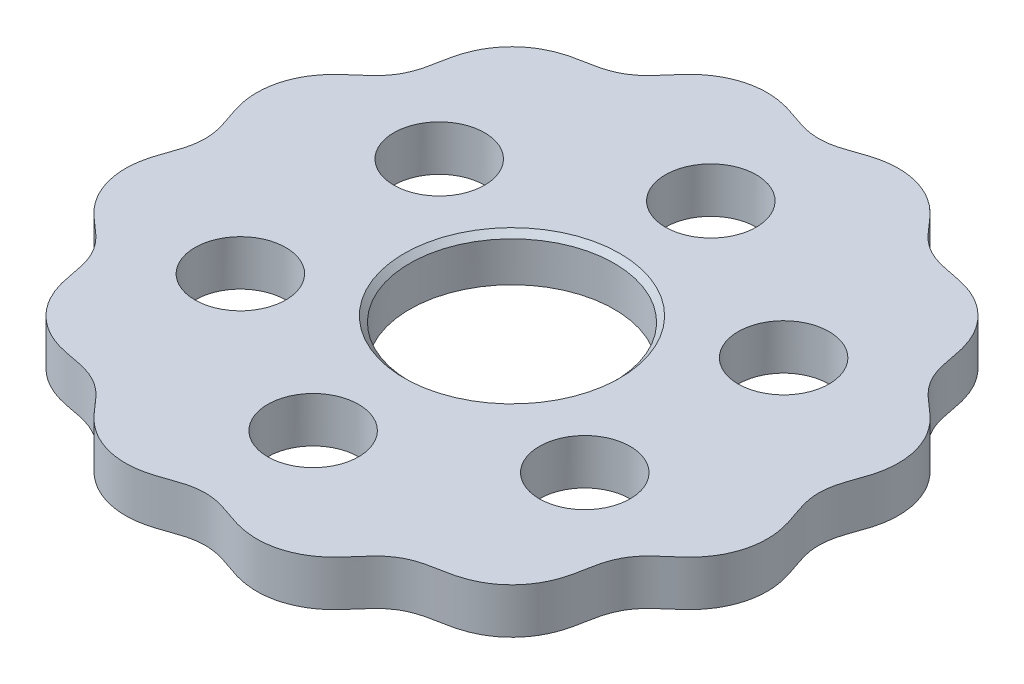
ISO-10303-21;
HEADER;
FILE_DESCRIPTION(('STEP AP214'),'2;1');
FILE_NAME('part.step','',(''),(''),'','','');
FILE_SCHEMA(('AUTOMOTIVE_DESIGN { 1 0 10303 214 1 1 1 1 }'));
ENDSEC;
DATA;
#1=APPLICATION_CONTEXT('core data for automotive mechanical design processes');
#2=APPLICATION_PROTOCOL_DEFINITION('international standard','automotive_design',2000,#1);
#3=PRODUCT_CONTEXT('',#1,'mechanical');
#4=PRODUCT('Part','Part','',(#3));
#5=PRODUCT_RELATED_PRODUCT_CATEGORY('part','',(#4));
#6=PRODUCT_DEFINITION_FORMATION('','',#4);
#7=PRODUCT_DEFINITION_CONTEXT('part definition',#1,'design');
#8=PRODUCT_DEFINITION('design','',#6,#7);
#9=PRODUCT_DEFINITION_SHAPE('','',#8);
#10=(LENGTH_UNIT() NAMED_UNIT(*) SI_UNIT(.MILLI.,.METRE.));
#11=(NAMED_UNIT(*) PLANE_ANGLE_UNIT() SI_UNIT($,.RADIAN.));
#12=(NAMED_UNIT(*) SI_UNIT($,.STERADIAN.) SOLID_ANGLE_UNIT());
#13=UNCERTAINTY_MEASURE_WITH_UNIT(LENGTH_MEASURE(1.E-05),#10,'distance_accuracy_value','');
#14=(GEOMETRIC_REPRESENTATION_CONTEXT(3) GLOBAL_UNCERTAINTY_ASSIGNED_CONTEXT((#13)) GLOBAL_UNIT_ASSIGNED_CONTEXT((#10,
#11,#12)) REPRESENTATION_CONTEXT('',''));
#15=CARTESIAN_POINT('',(0.,0.,0.));
#16=DIRECTION('',(0.,0.,1.));
#17=DIRECTION('',(1.,0.,0.));
#18=AXIS2_PLACEMENT_3D('',#15,#16,#17);
#19=CARTESIAN_POINT('',(27.,4.,9.22800886957361E-11));
#20=DIRECTION('',(-0.999999926527916,0.,-0.000383332964961151));
#21=DIRECTION('',(-0.000383332964961151,0.,0.999999926527916));
#22=AXIS2_PLACEMENT_3D('',#19,#20,#21);
#23=PLANE('',#22);
#24=CARTESIAN_POINT('',(27.,0.,9.22800886957361E-11));
#25=CARTESIAN_POINT('',(27.0000015716642,0.,-0.00409999716100518));
#26=B_SPLINE_CURVE_WITH_KNOTS('',1,(#24,#25),.UNSPECIFIED.,.F.,.F.,(2,2),(0.,1.),.UNSPECIFIED.);
#27=CARTESIAN_POINT('',(27.,0.,1.15350105787478E-10));
#28=VERTEX_POINT('',#27);
#29=CARTESIAN_POINT('',(27.0000015716642,0.,-0.0040999970740738));
#30=VERTEX_POINT('',#29);
#31=EDGE_CURVE('E83',#28,#30,#26,.T.);
#32=ORIENTED_EDGE('',*,*,#31,.T.);
#33=DIRECTION('',(0.,-1.,0.));
#34=VECTOR('',#33,1.);
#35=CARTESIAN_POINT('',(27.0000015716642,4.,-0.0040999970740738));
#36=LINE('',#35,#34);
#37=CARTESIAN_POINT('',(27.0000015716642,4.,-0.0040999970740738));
#38=VERTEX_POINT('',#37);
#39=EDGE_CURVE('E79',#38,#30,#36,.T.);
#40=ORIENTED_EDGE('',*,*,#39,.F.);
#41=CARTESIAN_POINT('',(27.,4.,9.22800886957361E-11));
#42=CARTESIAN_POINT('',(27.0000015716642,4.,-0.00409999716100518));
#43=B_SPLINE_CURVE_WITH_KNOTS('',1,(#41,#42),.UNSPECIFIED.,.F.,.F.,(2,2),(0.,1.),.UNSPECIFIED.);
#44=CARTESIAN_POINT('',(27.,4.,1.15350105787478E-10));
#45=VERTEX_POINT('',#44);
#46=EDGE_CURVE('E82',#45,#38,#43,.T.);
#47=ORIENTED_EDGE('',*,*,#46,.F.);
#48=DIRECTION('',(0.,-1.,0.));
#49=VECTOR('',#48,1.);
#50=CARTESIAN_POINT('',(27.,4.,1.15350105787478E-10));
#51=LINE('',#50,#49);
#52=EDGE_CURVE('E76',#45,#28,#51,.T.);
#53=ORIENTED_EDGE('',*,*,#52,.T.);
#54=EDGE_LOOP('',(#32,#40,#47,#53));
#55=FACE_BOUND('',#54,.T.);
#56=ADVANCED_FACE('F45',(#55),#23,.F.);
#57=CARTESIAN_POINT('',(27.0000015716642,4.,-0.0040999970740738));
#58=CARTESIAN_POINT('',(27.0000244484234,4.,-0.0339392810021794));
#59=CARTESIAN_POINT('',(27.0005304269458,4.,-0.07873320100623));
#60=CARTESIAN_POINT('',(27.002159238969,4.,-0.152753864287575));
#61=CARTESIAN_POINT('',(27.0079260189087,4.,-0.306185400184545));
#62=CARTESIAN_POINT('',(27.0198032377593,4.,-0.486134543892335));
#63=CARTESIAN_POINT('',(27.0442361711245,4.,-0.710209831575729));
#64=CARTESIAN_POINT('',(27.0884334298475,4.,-0.994680929823416));
#65=CARTESIAN_POINT('',(27.1457643024793,4.,-1.27114439302302));
#66=CARTESIAN_POINT('',(27.2321717977341,4.,-1.61674575590789));
#67=CARTESIAN_POINT('',(27.3560734123242,4.,-2.02396200951451));
#68=CARTESIAN_POINT('',(27.5210009056152,4.,-2.49350803824811));
#69=CARTESIAN_POINT('',(27.7162724516742,4.,-3.02678805022896));
#70=CARTESIAN_POINT('',(27.8972374228975,4.,-3.56570108518777));
#71=CARTESIAN_POINT('',(28.0642219258353,4.,-4.17060877528699));
#72=CARTESIAN_POINT('',(28.1930011060433,4.,-4.84554244802918));
#73=CARTESIAN_POINT('',(28.274636512001,4.,-5.79026897996571));
#74=CARTESIAN_POINT('',(28.1878772085396,4.,-6.99381965304455));
#75=CARTESIAN_POINT('',(27.8097902938465,4.,-8.35041784673789));
#76=CARTESIAN_POINT('',(27.0828678084063,4.,-9.64980286808452));
#77=CARTESIAN_POINT('',(26.1839296137999,4.,-10.6738779590738));
#78=CARTESIAN_POINT('',(25.2358125265582,4.,-11.4737802283782));
#79=CARTESIAN_POINT('',(24.370354005674,4.,-12.193123574296));
#80=CARTESIAN_POINT('',(23.6190605575602,4.,-13.0405595192683));
#81=CARTESIAN_POINT('',(23.0618295749504,4.,-14.027974654569));
#82=CARTESIAN_POINT('',(22.7225096076187,4.,-15.1079409428691));
#83=CARTESIAN_POINT('',(22.5401153959099,4.,-16.2179415220067));
#84=CARTESIAN_POINT('',(22.3106276044754,4.,-17.4374921197559));
#85=CARTESIAN_POINT('',(21.8545936867957,4.,-18.7217244182586));
#86=CARTESIAN_POINT('',(21.0767954527754,4.,-19.9840798535619));
#87=CARTESIAN_POINT('',(19.9418864008962,4.,-21.1099979467255));
#88=CARTESIAN_POINT('',(18.6734042785689,4.,-21.8777643942059));
#89=CARTESIAN_POINT('',(17.3858227799011,4.,-22.3240252437293));
#90=CARTESIAN_POINT('',(16.1654469621031,4.,-22.5476881375256));
#91=CARTESIAN_POINT('',(15.0558514955551,4.,-22.733997897836));
#92=CARTESIAN_POINT('',(13.9787577448736,4.,-23.0832138422773));
#93=CARTESIAN_POINT('',(12.9971431397588,4.,-23.6505932158244));
#94=CARTESIAN_POINT('',(12.1568472429252,4.,-24.409493008101));
#95=CARTESIAN_POINT('',(11.4410205779606,4.,-25.2775084306964));
#96=CARTESIAN_POINT('',(10.6367030906937,4.,-26.2222170973788));
#97=CARTESIAN_POINT('',(9.60578927405974,4.,-27.1134259413189));
#98=CARTESIAN_POINT('',(8.30610353361356,4.,-27.8270981610101));
#99=CARTESIAN_POINT('',(6.76325670490686,4.,-28.245828875078));
#100=CARTESIAN_POINT('',(5.28109437562332,4.,-28.2871231594632));
#101=CARTESIAN_POINT('',(3.94108532648328,4.,-28.0389745584077));
#102=CARTESIAN_POINT('',(2.77039275955104,4.,-27.627408479797));
#103=CARTESIAN_POINT('',(1.71776190423759,4.,-27.23068931312));
#104=CARTESIAN_POINT('',(0.612584807266868,4.,-26.985514684254));
#105=CARTESIAN_POINT('',(-0.521165890577715,4.,-26.9754952209441));
#106=CARTESIAN_POINT('',(-1.63049251996372,4.,-27.2033966215677));
#107=CARTESIAN_POINT('',(-2.68601217324515,4.,-27.5936229422302));
#108=CARTESIAN_POINT('',(-3.8530105532449,4.,-28.0143016070755));
#109=CARTESIAN_POINT('',(-5.18954444308002,4.,-28.2797825456004));
#110=CARTESIAN_POINT('',(-6.67836591286768,4.,-28.2585373638715));
#111=CARTESIAN_POINT('',(-8.23855985142709,4.,-27.8558107859252));
#112=CARTESIAN_POINT('',(-9.5592001005529,4.,-27.1475718954185));
#113=CARTESIAN_POINT('',(-10.6098942657333,4.,-26.250958295212));
#114=CARTESIAN_POINT('',(-11.4261266630729,4.,-25.2966701495425));
#115=CARTESIAN_POINT('',(-12.1475565882439,4.,-24.4184431986962));
#116=CARTESIAN_POINT('',(-12.9955308705807,4.,-23.6504733011948));
#117=CARTESIAN_POINT('',(-13.987888625458,4.,-23.0780544092839));
#118=CARTESIAN_POINT('',(-15.0771826127988,4.,-22.7284374440517));
#119=CARTESIAN_POINT('',(-16.198497390375,4.,-22.5430765422845));
#120=CARTESIAN_POINT('',(-17.4329889431198,4.,-22.3128862016379));
#121=CARTESIAN_POINT('',(-18.7345641510939,4.,-21.8505073756346));
#122=CARTESIAN_POINT('',(-20.0077601235838,4.,-21.0601479620353));
#123=CARTESIAN_POINT('',(-21.1359296453693,4.,-19.9096590050618));
#124=CARTESIAN_POINT('',(-21.8979671721226,4.,-18.6304633703646));
#125=CARTESIAN_POINT('',(-22.3355750875532,4.,-17.3400054274809));
#126=CARTESIAN_POINT('',(-22.554344619362,4.,-16.1189609672778));
#127=CARTESIAN_POINT('',(-22.7445040156435,4.,-15.0097784397211));
#128=CARTESIAN_POINT('',(-23.1025637929627,4.,-13.935358019104));
#129=CARTESIAN_POINT('',(-23.6788847882606,4.,-12.9589635684495));
#130=CARTESIAN_POINT('',(-24.4443617256028,4.,-12.1249831589227));
#131=CARTESIAN_POINT('',(-25.3144126941894,4.,-11.4119685054146));
#132=CARTESIAN_POINT('',(-26.2559014222923,4.,-10.6035408797703));
#133=CARTESIAN_POINT('',(-27.1402118481749,4.,-9.56661708953337));
#134=CARTESIAN_POINT('',(-27.8447418263077,4.,-8.26195281544402));
#135=CARTESIAN_POINT('',(-28.2525956334913,4.,-6.71619555673127));
#136=CARTESIAN_POINT('',(-28.2834838471351,4.,-5.23377926545721));
#137=CARTESIAN_POINT('',(-28.0263593102599,4.,-3.89553187590193));
#138=CARTESIAN_POINT('',(-27.6099703395077,4.,-2.72678284921799));
#139=CARTESIAN_POINT('',(-27.2164490273536,4.,-1.67272243958398));
#140=CARTESIAN_POINT('',(-26.9801395952342,4.,-0.565370051796549));
#141=CARTESIAN_POINT('',(-26.9804741873882,4.,0.5684228967716));
#142=CARTESIAN_POINT('',(-27.2173605456043,4.,1.67563666063786));
#143=CARTESIAN_POINT('',(-27.6110986637257,4.,2.72960050748098));
#144=CARTESIAN_POINT('',(-28.0271832981977,4.,3.89847299684735));
#145=CARTESIAN_POINT('',(-28.2837289031908,4.,5.23683637524653));
#146=CARTESIAN_POINT('',(-28.2521684066599,4.,6.71923822744481));
#147=CARTESIAN_POINT('',(-27.8436109551201,4.,8.26481003135531));
#148=CARTESIAN_POINT('',(-27.1384889851912,4.,9.56915416604704));
#149=CARTESIAN_POINT('',(-26.2537306947376,4.,10.6056908261978));
#150=CARTESIAN_POINT('',(-25.3120286722542,4.,11.4138474593151));
#151=CARTESIAN_POINT('',(-24.4421025478062,4.,12.1270350268679));
#152=CARTESIAN_POINT('',(-23.6770462052661,4.,12.9614232130097));
#153=CARTESIAN_POINT('',(-23.1013015770716,4.,13.9381572582798));
#154=CARTESIAN_POINT('',(-22.7438154949222,4.,15.0127542561048));
#155=CARTESIAN_POINT('',(-22.553915448645,4.,16.1219649218201));
#156=CARTESIAN_POINT('',(-22.3348376661072,4.,17.3429682603798));
#157=CARTESIAN_POINT('',(-21.8966704072072,4.,18.6332423824535));
#158=CARTESIAN_POINT('',(-21.1340538070914,4.,19.9120923021861));
#159=CARTESIAN_POINT('',(-20.0053600695423,4.,21.0620678102741));
#160=CARTESIAN_POINT('',(-18.7318062880613,4.,21.8518491030051));
#161=CARTESIAN_POINT('',(-17.4300345016617,4.,22.3136595922247));
#162=CARTESIAN_POINT('',(-16.1954960902811,4.,22.5435074477447));
#163=CARTESIAN_POINT('',(-15.0742060049806,4.,22.7290947932359));
#164=CARTESIAN_POINT('',(-13.9850809861389,4.,23.0792857186833));
#165=CARTESIAN_POINT('',(-12.9930603566187,4.,23.6522886562751));
#166=CARTESIAN_POINT('',(-12.1454986628799,4.,24.4206920699987));
#167=CARTESIAN_POINT('',(-11.4242529037972,4.,25.2990539408724));
#168=CARTESIAN_POINT('',(-10.6077475831555,4.,26.2531305077497));
#169=CARTESIAN_POINT('',(-9.5566594484237,4.,27.1492897931313));
#170=CARTESIAN_POINT('',(-8.23569735979198,4.,27.8569298047064));
#171=CARTESIAN_POINT('',(-6.67532074434484,4.,28.2589457050631));
#172=CARTESIAN_POINT('',(-5.18648932135376,4.,28.2795165230908));
#173=CARTESIAN_POINT('',(-3.85007580986316,4.,28.0134592087028));
#174=CARTESIAN_POINT('',(-2.68319605558515,4.,27.5924926678098));
#175=CARTESIAN_POINT('',(-1.6275712721048,4.,27.2025045616811));
#176=CARTESIAN_POINT('',(-0.518110613107215,4.,26.9751881182735));
#177=CARTESIAN_POINT('',(0.615634296059388,4.,26.9858765368276));
#178=CARTESIAN_POINT('',(1.72066862932771,4.,27.2316194918736));
#179=CARTESIAN_POINT('',(2.77321195882614,4.,27.6285337053039));
#180=CARTESIAN_POINT('',(3.94403247352572,4.,28.0397798951112));
#181=CARTESIAN_POINT('',(5.28415295259804,4.,28.2873471194994));
#182=CARTESIAN_POINT('',(6.76629662538961,4.,28.2453800939004));
#183=CARTESIAN_POINT('',(8.30895236179318,4.,27.8259472452917));
#184=CARTESIAN_POINT('',(9.60831453857364,4.,27.1116855367421));
#185=CARTESIAN_POINT('',(10.6388384981508,4.,26.2200332205968));
#186=CARTESIAN_POINT('',(11.442896635263,4.,25.275122475502));
#187=CARTESIAN_POINT('',(12.1589149325799,4.,24.4072462219114));
#188=CARTESIAN_POINT('',(12.9996193356664,4.,23.6487765490219));
#189=CARTESIAN_POINT('',(13.981568641392,4.,23.0819766425324));
#190=CARTESIAN_POINT('',(15.0588309737662,4.,22.7333297521329));
#191=CARTESIAN_POINT('',(16.1684512868352,4.,22.5472565277042));
#192=CARTESIAN_POINT('',(17.388781941976,4.,22.3232686931859));
#193=CARTESIAN_POINT('',(18.6761745371901,4.,21.8764484710044));
#194=CARTESIAN_POINT('',(19.9443080976805,4.,21.1081070033712));
#195=CARTESIAN_POINT('',(21.0787048087525,4.,19.981672159725));
#196=CARTESIAN_POINT('',(21.8559298352824,4.,18.7189640561845));
#197=CARTESIAN_POINT('',(22.3114045627037,4.,17.434537310411));
#198=CARTESIAN_POINT('',(22.54055069075,4.,16.2149374793626));
#199=CARTESIAN_POINT('',(22.7231565682339,4.,15.1049583669503));
#200=CARTESIAN_POINT('',(23.0630398461702,4.,14.0251524797909));
#201=CARTESIAN_POINT('',(23.620853175058,4.,13.0380662505843));
#202=CARTESIAN_POINT('',(24.372586568022,4.,12.191039395322));
#203=CARTESIAN_POINT('',(25.2381994727871,4.,11.4719059830387));
#204=CARTESIAN_POINT('',(26.1861270240563,4.,10.6717593207468));
#205=CARTESIAN_POINT('',(27.0846265424607,4.,9.64728898081318));
#206=CARTESIAN_POINT('',(27.8109872594051,4.,8.34753084721824));
#207=CARTESIAN_POINT('',(28.1884648125664,4.,6.99066698671307));
#208=CARTESIAN_POINT('',(28.2746521603342,4.,5.78697201722075));
#209=CARTESIAN_POINT('',(28.1925409617039,4.,4.84214050716381));
#210=CARTESIAN_POINT('',(28.0634270975877,4.,4.16720549021462));
#211=CARTESIAN_POINT('',(27.8961727407687,4.,3.56221827237287));
#212=CARTESIAN_POINT('',(27.7376816721069,4.,3.09077122652693));
#213=CARTESIAN_POINT('',(27.5929532296721,4.,2.6899152608719));
#214=CARTESIAN_POINT('',(27.4730469550011,4.,2.35559602405298));
#215=CARTESIAN_POINT('',(27.3801659464178,4.,2.08706705700083));
#216=CARTESIAN_POINT('',(27.2929902083367,4.,1.81659402118249));
#217=CARTESIAN_POINT('',(27.2138720005242,4.,1.54365220853864));
#218=CARTESIAN_POINT('',(27.1535107135987,4.,1.3023827818137));
#219=CARTESIAN_POINT('',(27.109159090362,4.,1.09391474556526));
#220=CARTESIAN_POINT('',(27.0775424292434,4.,0.919236466055205));
#221=CARTESIAN_POINT('',(27.0555988918368,4.,0.77865794264015));
#222=CARTESIAN_POINT('',(27.037127869559,4.,0.637409177069768));
#223=CARTESIAN_POINT('',(27.0222307277008,4.,0.497376741371319));
#224=CARTESIAN_POINT('',(27.0123933115686,4.,0.375375190333219));
#225=CARTESIAN_POINT('',(27.0062827399974,4.,0.263641882547648));
#226=CARTESIAN_POINT('',(27.0020443120296,4.,0.148526867702279));
#227=CARTESIAN_POINT('',(27.000471764553,4.,0.074622860545435));
#228=CARTESIAN_POINT('',(27.0000000000009,4.,0.0298433657233376));
#229=CARTESIAN_POINT('',(27.,4.,1.15350105787478E-10));
#230=B_SPLINE_CURVE_WITH_KNOTS('',4,(#57,#58,#59,#60,#61,#62,#63,#64,#65,#66,#67,#68,#69,#70,
#71,#72,#73,#74,#75,#76,#77,#78,#79,#80,#81,#82,#83,#84,#85,#86,#87,#88,#89,#90,#91,#92,#93,#94,
#95,#96,#97,#98,#99,#100,#101,#102,#103,#104,#105,#106,#107,#108,#109,#110,#111,#112,#113,#114,
#115,#116,#117,#118,#119,#120,#121,#122,#123,#124,#125,#126,#127,#128,#129,#130,#131,#132,#133,
#134,#135,#136,#137,#138,#139,#140,#141,#142,#143,#144,#145,#146,#147,#148,#149,#150,#151,#152,
#153,#154,#155,#156,#157,#158,#159,#160,#161,#162,#163,#164,#165,#166,#167,#168,#169,#170,#171,
#172,#173,#174,#175,#176,#177,#178,#179,#180,#181,#182,#183,#184,#185,#186,#187,#188,#189,#190,
#191,#192,#193,#194,#195,#196,#197,#198,#199,#200,#201,#202,#203,#204,#205,#206,#207,#208,#209,
#210,#211,#212,#213,#214,#215,#216,#217,#218,#219,#220,#221,#222,#223,#224,#225,#226,#227,#228,
#229),.UNSPECIFIED.,.F.,.F.,(5,1,1,1,1,1,1,1,1,1,1,1,1,1,1,1,1,1,1,1,1,1,1,1,1,1,1,1,1,1,1,1,1,
1,1,1,1,1,1,1,1,1,1,1,1,1,1,1,1,1,1,1,1,1,1,1,1,1,1,1,1,1,1,1,1,1,1,1,1,1,1,1,1,1,1,1,1,1,1,1,1,
1,1,1,1,1,1,1,1,1,1,1,1,1,1,1,1,1,1,1,1,1,1,1,1,1,1,1,1,1,1,1,1,1,1,1,1,1,1,1,1,1,1,1,1,1,1,1,1,
1,1,1,1,1,1,1,1,1,1,1,1,1,1,1,1,1,1,1,1,1,1,1,1,1,1,1,1,1,1,1,1,1,1,1,1,1,1,1,1,5),
(0.0798644491082758,0.0805110743862684,0.0808343870252647,0.081157699664261,0.0824509502202461,
0.0837442007762311,0.0850374513322162,0.0863307018882012,0.0876239524441863,0.0902104535561565,
0.0927969546681267,0.0953834557800969,0.097969956892067,0.100556458004037,0.104216614236069,
0.107876770468101,0.115197082932164,0.122406217836767,0.12961535274137,0.134736600459656,
0.139857848177942,0.144979095896228,0.150100343614515,0.155221409188006,0.160342474761498,
0.16546354033499,0.170584605908481,0.177793672105988,0.185002738303495,0.192211845114803,
0.199420951926112,0.20454210994399,0.209663267961869,0.214784425979748,0.219905583997626,
0.225026732689409,0.230147881381192,0.235269030072975,0.240390178764758,0.24759928212308,
0.254808385481402,0.262017455963055,0.269226526444708,0.274347600162707,0.279468673880706,
0.284589747598706,0.289710821316705,0.294832059635587,0.299953297954469,0.305074536273351,
0.310195774592233,0.317404906940895,0.324614039289556,0.331935362417552,0.339256685545547,
0.344430391650072,0.349604097754597,0.354777803859121,0.359951509963646,0.365125220533907,
0.370298931104167,0.375472641674427,0.380646352244688,0.38796767223086,0.395288992217032,
0.402498126618267,0.409707261019501,0.41482850686206,0.419949752704619,0.425070998547177,
0.430192244389736,0.435313311577422,0.440434378765107,0.445555445952793,0.450676513140478,
0.457885580201512,0.465094647262546,0.472303753390568,0.47951285951859,0.484634015666048,
0.489755171813506,0.494876327960964,0.499997484108422,0.505118634660025,0.510239785211628,
0.515360935763231,0.520482086314835,0.527691190371051,0.534900294427268,0.542109364058805,
0.549318433690342,0.554439505764926,0.559560577839511,0.564681649914095,0.56980272198868,
0.5749239621914,0.58004520239412,0.58516644259684,0.59028768279956,0.597496815667218,
0.604705948534877,0.612027270887487,0.619348593240097,0.6245223004472,0.629696007654304,
0.634869714861407,0.640043422068511,0.645217131534123,0.650390840999735,0.655564550465347,
0.66073825993096,0.668059580712651,0.675380901494343,0.682590035388293,0.689799169282243,
0.6949204132469,0.700041657211558,0.705162901176215,0.710284145140872,0.715405213950202,
0.720526282759533,0.725647351568864,0.730768420378195,0.737977488299415,0.745186556220635,
0.752395661661707,0.75960476710278,0.76472592138232,0.76984707566186,0.7749682299414,
0.78008938422094,0.785210536635162,0.790331689049384,0.795452841463606,0.800573993877827,
0.807783098628297,0.814992203378766,0.822201272156822,0.829410340934878,0.834531411373208,
0.839652481811537,0.844773552249867,0.849894622688196,0.855015864772874,0.860137106857552,
0.86525834894223,0.870379591026908,0.877588724409665,0.884797857792421,0.892119179362928,
0.895779840148182,0.899440500933435,0.902027355101441,0.904614209269448,0.907201063437454,
0.908494490521457,0.909787917605461,0.911081344689464,0.912374771773467,0.91366819885747,
0.914961625941473,0.915608339483475,0.916255053025477,0.916901766567478,0.91754848010948,
0.918195193651481,0.918841907193483,0.919165263964484,0.919488620735485,0.920135334277486),.UNSPECIFIED.);
#231=DIRECTION('',(0.,-1.,0.));
#232=VECTOR('',#231,1.);
#233=SURFACE_OF_LINEAR_EXTRUSION('',#230,#232);
#234=CARTESIAN_POINT('',(27.0000015716642,0.,-0.0040999970740738));
#235=CARTESIAN_POINT('',(27.0000244484234,0.,-0.0339392810021794));
#236=CARTESIAN_POINT('',(27.0005304269458,0.,-0.07873320100623));
#237=CARTESIAN_POINT('',(27.002159238969,0.,-0.152753864287575));
#238=CARTESIAN_POINT('',(27.0079260189087,0.,-0.306185400184545));
#239=CARTESIAN_POINT('',(27.0198032377593,0.,-0.486134543892335));
#240=CARTESIAN_POINT('',(27.0442361711245,0.,-0.710209831575729));
#241=CARTESIAN_POINT('',(27.0884334298475,0.,-0.994680929823416));
#242=CARTESIAN_POINT('',(27.1457643024793,0.,-1.27114439302302));
#243=CARTESIAN_POINT('',(27.2321717977341,0.,-1.61674575590789));
#244=CARTESIAN_POINT('',(27.3560734123242,0.,-2.02396200951451));
#245=CARTESIAN_POINT('',(27.5210009056152,0.,-2.49350803824811));
#246=CARTESIAN_POINT('',(27.7162724516742,0.,-3.02678805022896));
#247=CARTESIAN_POINT('',(27.8972374228975,0.,-3.56570108518777));
#248=CARTESIAN_POINT('',(28.0642219258353,0.,-4.17060877528699));
#249=CARTESIAN_POINT('',(28.1930011060433,0.,-4.84554244802918));
#250=CARTESIAN_POINT('',(28.274636512001,0.,-5.79026897996571));
#251=CARTESIAN_POINT('',(28.1878772085396,0.,-6.99381965304455));
#252=CARTESIAN_POINT('',(27.8097902938465,0.,-8.35041784673789));
#253=CARTESIAN_POINT('',(27.0828678084063,0.,-9.64980286808452));
#254=CARTESIAN_POINT('',(26.1839296137999,0.,-10.6738779590738));
#255=CARTESIAN_POINT('',(25.2358125265582,0.,-11.4737802283782));
#256=CARTESIAN_POINT('',(24.370354005674,0.,-12.193123574296));
#257=CARTESIAN_POINT('',(23.6190605575602,0.,-13.0405595192683));
#258=CARTESIAN_POINT('',(23.0618295749504,0.,-14.027974654569));
#259=CARTESIAN_POINT('',(22.7225096076187,0.,-15.1079409428691));
#260=CARTESIAN_POINT('',(22.5401153959099,0.,-16.2179415220067));
#261=CARTESIAN_POINT('',(22.3106276044754,0.,-17.4374921197559));
#262=CARTESIAN_POINT('',(21.8545936867957,0.,-18.7217244182586));
#263=CARTESIAN_POINT('',(21.0767954527754,0.,-19.9840798535619));
#264=CARTESIAN_POINT('',(19.9418864008962,0.,-21.1099979467255));
#265=CARTESIAN_POINT('',(18.6734042785689,0.,-21.8777643942059));
#266=CARTESIAN_POINT('',(17.3858227799011,0.,-22.3240252437293));
#267=CARTESIAN_POINT('',(16.1654469621031,0.,-22.5476881375256));
#268=CARTESIAN_POINT('',(15.0558514955551,0.,-22.733997897836));
#269=CARTESIAN_POINT('',(13.9787577448736,0.,-23.0832138422773));
#270=CARTESIAN_POINT('',(12.9971431397588,0.,-23.6505932158244));
#271=CARTESIAN_POINT('',(12.1568472429252,0.,-24.409493008101));
#272=CARTESIAN_POINT('',(11.4410205779606,0.,-25.2775084306964));
#273=CARTESIAN_POINT('',(10.6367030906937,0.,-26.2222170973788));
#274=CARTESIAN_POINT('',(9.60578927405974,0.,-27.1134259413189));
#275=CARTESIAN_POINT('',(8.30610353361356,0.,-27.8270981610101));
#276=CARTESIAN_POINT('',(6.76325670490686,0.,-28.245828875078));
#277=CARTESIAN_POINT('',(5.28109437562332,0.,-28.2871231594632));
#278=CARTESIAN_POINT('',(3.94108532648328,0.,-28.0389745584077));
#279=CARTESIAN_POINT('',(2.77039275955104,0.,-27.627408479797));
#280=CARTESIAN_POINT('',(1.71776190423759,0.,-27.23068931312));
#281=CARTESIAN_POINT('',(0.612584807266868,0.,-26.985514684254));
#282=CARTESIAN_POINT('',(-0.521165890577715,0.,-26.9754952209441));
#283=CARTESIAN_POINT('',(-1.63049251996372,0.,-27.2033966215677));
#284=CARTESIAN_POINT('',(-2.68601217324515,0.,-27.5936229422302));
#285=CARTESIAN_POINT('',(-3.8530105532449,0.,-28.0143016070755));
#286=CARTESIAN_POINT('',(-5.18954444308002,0.,-28.2797825456004));
#287=CARTESIAN_POINT('',(-6.67836591286768,0.,-28.2585373638715));
#288=CARTESIAN_POINT('',(-8.23855985142709,0.,-27.8558107859252));
#289=CARTESIAN_POINT('',(-9.5592001005529,0.,-27.1475718954185));
#290=CARTESIAN_POINT('',(-10.6098942657333,0.,-26.250958295212));
#291=CARTESIAN_POINT('',(-11.4261266630729,0.,-25.2966701495425));
#292=CARTESIAN_POINT('',(-12.1475565882439,0.,-24.4184431986962));
#293=CARTESIAN_POINT('',(-12.9955308705807,0.,-23.6504733011948));
#294=CARTESIAN_POINT('',(-13.987888625458,0.,-23.0780544092839));
#295=CARTESIAN_POINT('',(-15.0771826127988,0.,-22.7284374440517));
#296=CARTESIAN_POINT('',(-16.198497390375,0.,-22.5430765422845));
#297=CARTESIAN_POINT('',(-17.4329889431198,0.,-22.3128862016379));
#298=CARTESIAN_POINT('',(-18.7345641510939,0.,-21.8505073756346));
#299=CARTESIAN_POINT('',(-20.0077601235838,0.,-21.0601479620353));
#300=CARTESIAN_POINT('',(-21.1359296453693,0.,-19.9096590050618));
#301=CARTESIAN_POINT('',(-21.8979671721226,0.,-18.6304633703646));
#302=CARTESIAN_POINT('',(-22.3355750875532,0.,-17.3400054274809));
#303=CARTESIAN_POINT('',(-22.554344619362,0.,-16.1189609672778));
#304=CARTESIAN_POINT('',(-22.7445040156435,0.,-15.0097784397211));
#305=CARTESIAN_POINT('',(-23.1025637929627,0.,-13.935358019104));
#306=CARTESIAN_POINT('',(-23.6788847882606,0.,-12.9589635684495));
#307=CARTESIAN_POINT('',(-24.4443617256028,0.,-12.1249831589227));
#308=CARTESIAN_POINT('',(-25.3144126941894,0.,-11.4119685054146));
#309=CARTESIAN_POINT('',(-26.2559014222923,0.,-10.6035408797703));
#310=CARTESIAN_POINT('',(-27.1402118481749,0.,-9.56661708953337));
#311=CARTESIAN_POINT('',(-27.8447418263077,0.,-8.26195281544402));
#312=CARTESIAN_POINT('',(-28.2525956334913,0.,-6.71619555673127));
#313=CARTESIAN_POINT('',(-28.2834838471351,0.,-5.23377926545721));
#314=CARTESIAN_POINT('',(-28.0263593102599,0.,-3.89553187590193));
#315=CARTESIAN_POINT('',(-27.6099703395077,0.,-2.72678284921799));
#316=CARTESIAN_POINT('',(-27.2164490273536,0.,-1.67272243958398));
#317=CARTESIAN_POINT('',(-26.9801395952342,0.,-0.565370051796549));
#318=CARTESIAN_POINT('',(-26.9804741873882,0.,0.5684228967716));
#319=CARTESIAN_POINT('',(-27.2173605456043,0.,1.67563666063786));
#320=CARTESIAN_POINT('',(-27.6110986637257,0.,2.72960050748098));
#321=CARTESIAN_POINT('',(-28.0271832981977,0.,3.89847299684735));
#322=CARTESIAN_POINT('',(-28.2837289031908,0.,5.23683637524653));
#323=CARTESIAN_POINT('',(-28.2521684066599,0.,6.71923822744481));
#324=CARTESIAN_POINT('',(-27.8436109551201,0.,8.26481003135531));
#325=CARTESIAN_POINT('',(-27.1384889851912,0.,9.56915416604704));
#326=CARTESIAN_POINT('',(-26.2537306947376,0.,10.6056908261978));
#327=CARTESIAN_POINT('',(-25.3120286722542,0.,11.4138474593151));
#328=CARTESIAN_POINT('',(-24.4421025478062,0.,12.1270350268679));
#329=CARTESIAN_POINT('',(-23.6770462052661,0.,12.9614232130097));
#330=CARTESIAN_POINT('',(-23.1013015770716,0.,13.9381572582798));
#331=CARTESIAN_POINT('',(-22.7438154949222,0.,15.0127542561048));
#332=CARTESIAN_POINT('',(-22.553915448645,0.,16.1219649218201));
#333=CARTESIAN_POINT('',(-22.3348376661072,0.,17.3429682603798));
#334=CARTESIAN_POINT('',(-21.8966704072072,0.,18.6332423824535));
#335=CARTESIAN_POINT('',(-21.1340538070914,0.,19.9120923021861));
#336=CARTESIAN_POINT('',(-20.0053600695423,0.,21.0620678102741));
#337=CARTESIAN_POINT('',(-18.7318062880613,0.,21.8518491030051));
#338=CARTESIAN_POINT('',(-17.4300345016617,0.,22.3136595922247));
#339=CARTESIAN_POINT('',(-16.1954960902811,0.,22.5435074477447));
#340=CARTESIAN_POINT('',(-15.0742060049806,0.,22.7290947932359));
#341=CARTESIAN_POINT('',(-13.9850809861389,0.,23.0792857186833));
#342=CARTESIAN_POINT('',(-12.9930603566187,0.,23.6522886562751));
#343=CARTESIAN_POINT('',(-12.1454986628799,0.,24.4206920699987));
#344=CARTESIAN_POINT('',(-11.4242529037972,0.,25.2990539408724));
#345=CARTESIAN_POINT('',(-10.6077475831555,0.,26.2531305077497));
#346=CARTESIAN_POINT('',(-9.5566594484237,0.,27.1492897931313));
#347=CARTESIAN_POINT('',(-8.23569735979198,0.,27.8569298047064));
#348=CARTESIAN_POINT('',(-6.67532074434484,0.,28.2589457050631));
#349=CARTESIAN_POINT('',(-5.18648932135376,0.,28.2795165230908));
#350=CARTESIAN_POINT('',(-3.85007580986316,0.,28.0134592087028));
#351=CARTESIAN_POINT('',(-2.68319605558515,0.,27.5924926678098));
#352=CARTESIAN_POINT('',(-1.6275712721048,0.,27.2025045616811));
#353=CARTESIAN_POINT('',(-0.518110613107215,0.,26.9751881182735));
#354=CARTESIAN_POINT('',(0.615634296059388,0.,26.9858765368276));
#355=CARTESIAN_POINT('',(1.72066862932771,0.,27.2316194918736));
#356=CARTESIAN_POINT('',(2.77321195882614,0.,27.6285337053039));
#357=CARTESIAN_POINT('',(3.94403247352572,0.,28.0397798951112));
#358=CARTESIAN_POINT('',(5.28415295259804,0.,28.2873471194994));
#359=CARTESIAN_POINT('',(6.76629662538961,0.,28.2453800939004));
#360=CARTESIAN_POINT('',(8.30895236179318,0.,27.8259472452917));
#361=CARTESIAN_POINT('',(9.60831453857364,0.,27.1116855367421));
#362=CARTESIAN_POINT('',(10.6388384981508,0.,26.2200332205968));
#363=CARTESIAN_POINT('',(11.442896635263,0.,25.275122475502));
#364=CARTESIAN_POINT('',(12.1589149325799,0.,24.4072462219114));
#365=CARTESIAN_POINT('',(12.9996193356664,0.,23.6487765490219));
#366=CARTESIAN_POINT('',(13.981568641392,0.,23.0819766425324));
#367=CARTESIAN_POINT('',(15.0588309737662,0.,22.7333297521329));
#368=CARTESIAN_POINT('',(16.1684512868352,0.,22.5472565277042));
#369=CARTESIAN_POINT('',(17.388781941976,0.,22.3232686931859));
#370=CARTESIAN_POINT('',(18.6761745371901,0.,21.8764484710044));
#371=CARTESIAN_POINT('',(19.9443080976805,0.,21.1081070033712));
#372=CARTESIAN_POINT('',(21.0787048087525,0.,19.981672159725));
#373=CARTESIAN_POINT('',(21.8559298352824,0.,18.7189640561845));
#374=CARTESIAN_POINT('',(22.3114045627037,0.,17.434537310411));
#375=CARTESIAN_POINT('',(22.54055069075,0.,16.2149374793626));
#376=CARTESIAN_POINT('',(22.7231565682339,0.,15.1049583669503));
#377=CARTESIAN_POINT('',(23.0630398461702,0.,14.0251524797909));
#378=CARTESIAN_POINT('',(23.620853175058,0.,13.0380662505843));
#379=CARTESIAN_POINT('',(24.372586568022,0.,12.191039395322));
#380=CARTESIAN_POINT('',(25.2381994727871,0.,11.4719059830387));
#381=CARTESIAN_POINT('',(26.1861270240563,0.,10.6717593207468));
#382=CARTESIAN_POINT('',(27.0846265424607,0.,9.64728898081318));
#383=CARTESIAN_POINT('',(27.8109872594051,0.,8.34753084721824));
#384=CARTESIAN_POINT('',(28.1884648125664,0.,6.99066698671307));
#385=CARTESIAN_POINT('',(28.2746521603342,0.,5.78697201722075));
#386=CARTESIAN_POINT('',(28.1925409617039,0.,4.84214050716381));
#387=CARTESIAN_POINT('',(28.0634270975877,0.,4.16720549021462));
#388=CARTESIAN_POINT('',(27.8961727407687,0.,3.56221827237287));
#389=CARTESIAN_POINT('',(27.7376816721069,0.,3.09077122652693));
#390=CARTESIAN_POINT('',(27.5929532296721,0.,2.6899152608719));
#391=CARTESIAN_POINT('',(27.4730469550011,0.,2.35559602405298));
#392=CARTESIAN_POINT('',(27.3801659464178,0.,2.08706705700083));
#393=CARTESIAN_POINT('',(27.2929902083367,0.,1.81659402118249));
#394=CARTESIAN_POINT('',(27.2138720005242,0.,1.54365220853864));
#395=CARTESIAN_POINT('',(27.1535107135987,0.,1.3023827818137));
#396=CARTESIAN_POINT('',(27.109159090362,0.,1.09391474556526));
#397=CARTESIAN_POINT('',(27.0775424292434,0.,0.919236466055205));
#398=CARTESIAN_POINT('',(27.0555988918368,0.,0.77865794264015));
#399=CARTESIAN_POINT('',(27.037127869559,0.,0.637409177069768));
#400=CARTESIAN_POINT('',(27.0222307277008,0.,0.497376741371319));
#401=CARTESIAN_POINT('',(27.0123933115686,0.,0.375375190333219));
#402=CARTESIAN_POINT('',(27.0062827399974,0.,0.263641882547648));
#403=CARTESIAN_POINT('',(27.0020443120296,0.,0.148526867702279));
#404=CARTESIAN_POINT('',(27.000471764553,0.,0.074622860545435));
#405=CARTESIAN_POINT('',(27.0000000000009,0.,0.0298433657233376));
#406=CARTESIAN_POINT('',(27.,0.,1.15350105787478E-10));
#407=B_SPLINE_CURVE_WITH_KNOTS('',4,(#234,#235,#236,#237,#238,#239,#240,#241,#242,#243,#244,
#245,#246,#247,#248,#249,#250,#251,#252,#253,#254,#255,#256,#257,#258,#259,#260,#261,#262,#263,
#264,#265,#266,#267,#268,#269,#270,#271,#272,#273,#274,#275,#276,#277,#278,#279,#280,#281,#282,
#283,#284,#285,#286,#287,#288,#289,#290,#291,#292,#293,#294,#295,#296,#297,#298,#299,#300,#301,
#302,#303,#304,#305,#306,#307,#308,#309,#310,#311,#312,#313,#314,#315,#316,#317,#318,#319,#320,
#321,#322,#323,#324,#325,#326,#327,#328,#329,#330,#331,#332,#333,#334,#335,#336,#337,#338,#339,
#340,#341,#342,#343,#344,#345,#346,#347,#348,#349,#350,#351,#352,#353,#354,#355,#356,#357,#358,
#359,#360,#361,#362,#363,#364,#365,#366,#367,#368,#369,#370,#371,#372,#373,#374,#375,#376,#377,
#378,#379,#380,#381,#382,#383,#384,#385,#386,#387,#388,#389,#390,#391,#392,#393,#394,#395,#396,
#397,#398,#399,#400,#401,#402,#403,#404,#405,#406),.UNSPECIFIED.,.F.,.F.,(5,1,1,1,1,1,1,1,1,1,1,
1,1,1,1,1,1,1,1,1,1,1,1,1,1,1,1,1,1,1,1,1,1,1,1,1,1,1,1,1,1,1,1,1,1,1,1,1,1,1,1,1,1,1,1,1,1,1,1,
1,1,1,1,1,1,1,1,1,1,1,1,1,1,1,1,1,1,1,1,1,1,1,1,1,1,1,1,1,1,1,1,1,1,1,1,1,1,1,1,1,1,1,1,1,1,1,1,
1,1,1,1,1,1,1,1,1,1,1,1,1,1,1,1,1,1,1,1,1,1,1,1,1,1,1,1,1,1,1,1,1,1,1,1,1,1,1,1,1,1,1,1,1,1,1,1,
1,1,1,1,1,1,1,1,1,1,1,1,1,1,5),(0.0798644491082758,0.0805110743862684,0.0808343870252647,
0.081157699664261,0.0824509502202461,0.0837442007762311,0.0850374513322162,0.0863307018882012,
0.0876239524441863,0.0902104535561565,0.0927969546681267,0.0953834557800969,0.097969956892067,
0.100556458004037,0.104216614236069,0.107876770468101,0.115197082932164,0.122406217836767,
0.12961535274137,0.134736600459656,0.139857848177942,0.144979095896228,0.150100343614515,
0.155221409188006,0.160342474761498,0.16546354033499,0.170584605908481,0.177793672105988,
0.185002738303495,0.192211845114803,0.199420951926112,0.20454210994399,0.209663267961869,
0.214784425979748,0.219905583997626,0.225026732689409,0.230147881381192,0.235269030072975,
0.240390178764758,0.24759928212308,0.254808385481402,0.262017455963055,0.269226526444708,
0.274347600162707,0.279468673880706,0.284589747598706,0.289710821316705,0.294832059635587,
0.299953297954469,0.305074536273351,0.310195774592233,0.317404906940895,0.324614039289556,
0.331935362417552,0.339256685545547,0.344430391650072,0.349604097754597,0.354777803859121,
0.359951509963646,0.365125220533907,0.370298931104167,0.375472641674427,0.380646352244688,
0.38796767223086,0.395288992217032,0.402498126618267,0.409707261019501,0.41482850686206,
0.419949752704619,0.425070998547177,0.430192244389736,0.435313311577422,0.440434378765107,
0.445555445952793,0.450676513140478,0.457885580201512,0.465094647262546,0.472303753390568,
0.47951285951859,0.484634015666048,0.489755171813506,0.494876327960964,0.499997484108422,
0.505118634660025,0.510239785211628,0.515360935763231,0.520482086314835,0.527691190371051,
0.534900294427268,0.542109364058805,0.549318433690342,0.554439505764926,0.559560577839511,
0.564681649914095,0.56980272198868,0.5749239621914,0.58004520239412,0.58516644259684,
0.59028768279956,0.597496815667218,0.604705948534877,0.612027270887487,0.619348593240097,
0.6245223004472,0.629696007654304,0.634869714861407,0.640043422068511,0.645217131534123,
0.650390840999735,0.655564550465347,0.66073825993096,0.668059580712651,0.675380901494343,
0.682590035388293,0.689799169282243,0.6949204132469,0.700041657211558,0.705162901176215,
0.710284145140872,0.715405213950202,0.720526282759533,0.725647351568864,0.730768420378195,
0.737977488299415,0.745186556220635,0.752395661661707,0.75960476710278,0.76472592138232,
0.76984707566186,0.7749682299414,0.78008938422094,0.785210536635162,0.790331689049384,
0.795452841463606,0.800573993877827,0.807783098628297,0.814992203378766,0.822201272156822,
0.829410340934878,0.834531411373208,0.839652481811537,0.844773552249867,0.849894622688196,
0.855015864772874,0.860137106857552,0.86525834894223,0.870379591026908,0.877588724409665,
0.884797857792421,0.892119179362928,0.895779840148182,0.899440500933435,0.902027355101441,
0.904614209269448,0.907201063437454,0.908494490521457,0.909787917605461,0.911081344689464,
0.912374771773467,0.91366819885747,0.914961625941473,0.915608339483475,0.916255053025477,
0.916901766567478,0.91754848010948,0.918195193651481,0.918841907193483,0.919165263964484,
0.919488620735485,0.920135334277486),.UNSPECIFIED.);
#408=EDGE_CURVE('E71',#30,#28,#407,.T.);
#409=ORIENTED_EDGE('',*,*,#408,.T.);
#410=ORIENTED_EDGE('',*,*,#52,.F.);
#411=EDGE_CURVE('E63',#38,#45,#230,.T.);
#412=ORIENTED_EDGE('',*,*,#411,.F.);
#413=ORIENTED_EDGE('',*,*,#39,.T.);
#414=EDGE_LOOP('',(#409,#410,#412,#413));
#415=FACE_BOUND('',#414,.T.);
#416=ADVANCED_FACE('F75',(#415),#233,.F.);
#417=CARTESIAN_POINT('',(-27.0000235590326,4.,0.00205015769441836));
#418=DIRECTION('',(0.,-1.,0.));
#419=DIRECTION('',(0.,0.,-1.));
#420=AXIS2_PLACEMENT_3D('',#417,#418,#419);
#421=PLANE('',#420);
#422=CARTESIAN_POINT('',(0.,4.,0.));
#423=DIRECTION('',(0.,-1.,0.));
#424=DIRECTION('',(0.,0.,-1.));
#425=AXIS2_PLACEMENT_3D('',#422,#423,#424);
#426=CIRCLE('',#425,9.50000000000002);
#427=CARTESIAN_POINT('',(0.,4.,-9.50000000000002));
#428=VERTEX_POINT('',#427);
#429=EDGE_CURVE('E11',#428,#428,#426,.T.);
#430=ORIENTED_EDGE('',*,*,#429,.T.);
#431=EDGE_LOOP('',(#430));
#432=FACE_BOUND('',#431,.T.);
#433=CARTESIAN_POINT('',(0.,4.,-17.5));
#434=DIRECTION('',(0.,1.,0.));
#435=DIRECTION('',(0.,0.,1.));
#436=AXIS2_PLACEMENT_3D('',#433,#434,#435);
#437=CIRCLE('',#436,4.);
#438=CARTESIAN_POINT('',(0.,4.,-13.5));
#439=VERTEX_POINT('',#438);
#440=EDGE_CURVE('E120',#439,#439,#437,.T.);
#441=ORIENTED_EDGE('',*,*,#440,.F.);
#442=EDGE_LOOP('',(#441));
#443=FACE_BOUND('',#442,.T.);
#444=CARTESIAN_POINT('',(-15.1554445662276,4.,-8.75000000000018));
#445=DIRECTION('',(0.,1.,0.));
#446=DIRECTION('',(0.,0.,1.));
#447=AXIS2_PLACEMENT_3D('',#444,#445,#446);
#448=CIRCLE('',#447,4.);
#449=CARTESIAN_POINT('',(-15.1554445662276,4.,-4.75000000000018));
#450=VERTEX_POINT('',#449);
#451=EDGE_CURVE('E195',#450,#450,#448,.T.);
#452=ORIENTED_EDGE('',*,*,#451,.F.);
#453=EDGE_LOOP('',(#452));
#454=FACE_BOUND('',#453,.T.);
#455=CARTESIAN_POINT('',(-15.1554445662277,4.,8.75000000000001));
#456=DIRECTION('',(0.,1.,0.));
#457=DIRECTION('',(0.,0.,1.));
#458=AXIS2_PLACEMENT_3D('',#455,#456,#457);
#459=CIRCLE('',#458,4.00000000000016);
#460=CARTESIAN_POINT('',(-15.1554445662277,4.,12.7500000000002));
#461=VERTEX_POINT('',#460);
#462=EDGE_CURVE('E198',#461,#461,#459,.T.);
#463=ORIENTED_EDGE('',*,*,#462,.F.);
#464=EDGE_LOOP('',(#463));
#465=FACE_BOUND('',#464,.T.);
#466=CARTESIAN_POINT('',(-1.2220184685951E-13,4.,17.5));
#467=DIRECTION('',(0.,1.,0.));
#468=DIRECTION('',(0.,0.,1.));
#469=AXIS2_PLACEMENT_3D('',#466,#467,#468);
#470=CIRCLE('',#469,4.);
#471=CARTESIAN_POINT('',(-1.2220184685951E-13,4.,21.5));
#472=VERTEX_POINT('',#471);
#473=EDGE_CURVE('E203',#472,#472,#470,.T.);
#474=ORIENTED_EDGE('',*,*,#473,.F.);
#475=EDGE_LOOP('',(#474));
#476=FACE_BOUND('',#475,.T.);
#477=CARTESIAN_POINT('',(15.1554445662276,4.,8.75000000000007));
#478=DIRECTION('',(0.,1.,0.));
#479=DIRECTION('',(0.,0.,1.));
#480=AXIS2_PLACEMENT_3D('',#477,#478,#479);
#481=CIRCLE('',#480,4.);
#482=CARTESIAN_POINT('',(15.1554445662276,4.,12.7500000000001));
#483=VERTEX_POINT('',#482);
#484=EDGE_CURVE('E211',#483,#483,#481,.T.);
#485=ORIENTED_EDGE('',*,*,#484,.F.);
#486=EDGE_LOOP('',(#485));
#487=FACE_BOUND('',#486,.T.);
#488=CARTESIAN_POINT('',(15.1554445662277,4.,-8.74999999999997));
#489=DIRECTION('',(0.,1.,0.));
#490=DIRECTION('',(0.,0.,1.));
#491=AXIS2_PLACEMENT_3D('',#488,#489,#490);
#492=CIRCLE('',#491,4.);
#493=CARTESIAN_POINT('',(15.1554445662277,4.,-4.74999999999997));
#494=VERTEX_POINT('',#493);
#495=EDGE_CURVE('E207',#494,#494,#492,.T.);
#496=ORIENTED_EDGE('',*,*,#495,.F.);
#497=EDGE_LOOP('',(#496));
#498=FACE_BOUND('',#497,.T.);
#499=ORIENTED_EDGE('',*,*,#46,.T.);
#500=ORIENTED_EDGE('',*,*,#411,.T.);
#501=EDGE_LOOP('',(#499,#500));
#502=FACE_BOUND('',#501,.T.);
#503=ADVANCED_FACE('F161',(#432,#443,#454,#465,#476,#487,#498,#502),#421,.F.);
#504=CARTESIAN_POINT('',(-27.0000235590326,0.,0.00205015769441836));
#505=DIRECTION('',(0.,-1.,0.));
#506=DIRECTION('',(0.,0.,-1.));
#507=AXIS2_PLACEMENT_3D('',#504,#505,#506);
#508=PLANE('',#507);
#509=CARTESIAN_POINT('',(0.,0.,-17.5));
#510=DIRECTION('',(0.,-1.,0.));
#511=DIRECTION('',(0.,0.,-1.));
#512=AXIS2_PLACEMENT_3D('',#509,#510,#511);
#513=CIRCLE('',#512,4.);
#514=CARTESIAN_POINT('',(0.,0.,-21.5));
#515=VERTEX_POINT('',#514);
#516=EDGE_CURVE('E95',#515,#515,#513,.T.);
#517=ORIENTED_EDGE('',*,*,#516,.F.);
#518=EDGE_LOOP('',(#517));
#519=FACE_BOUND('',#518,.T.);
#520=CARTESIAN_POINT('',(-15.1554445662276,0.,-8.75000000000018));
#521=DIRECTION('',(0.,-1.,0.));
#522=DIRECTION('',(0.,0.,-1.));
#523=AXIS2_PLACEMENT_3D('',#520,#521,#522);
#524=CIRCLE('',#523,4.);
#525=CARTESIAN_POINT('',(-15.1554445662276,0.,-12.7500000000002));
#526=VERTEX_POINT('',#525);
#527=EDGE_CURVE('E132',#526,#526,#524,.T.);
#528=ORIENTED_EDGE('',*,*,#527,.F.);
#529=EDGE_LOOP('',(#528));
#530=FACE_BOUND('',#529,.T.);
#531=CARTESIAN_POINT('',(-15.1554445662277,0.,8.75000000000001));
#532=DIRECTION('',(0.,-1.,0.));
#533=DIRECTION('',(0.,0.,-1.));
#534=AXIS2_PLACEMENT_3D('',#531,#532,#533);
#535=CIRCLE('',#534,4.00000000000016);
#536=CARTESIAN_POINT('',(-15.1554445662277,0.,4.74999999999985));
#537=VERTEX_POINT('',#536);
#538=EDGE_CURVE('E128',#537,#537,#535,.T.);
#539=ORIENTED_EDGE('',*,*,#538,.F.);
#540=EDGE_LOOP('',(#539));
#541=FACE_BOUND('',#540,.T.);
#542=CARTESIAN_POINT('',(-1.2220184685951E-13,0.,17.5));
#543=DIRECTION('',(0.,-1.,0.));
#544=DIRECTION('',(0.,0.,-1.));
#545=AXIS2_PLACEMENT_3D('',#542,#543,#544);
#546=CIRCLE('',#545,4.);
#547=CARTESIAN_POINT('',(-1.2220184685951E-13,0.,13.5));
#548=VERTEX_POINT('',#547);
#549=EDGE_CURVE('E124',#548,#548,#546,.T.);
#550=ORIENTED_EDGE('',*,*,#549,.F.);
#551=EDGE_LOOP('',(#550));
#552=FACE_BOUND('',#551,.T.);
#553=CARTESIAN_POINT('',(15.1554445662276,0.,8.75000000000007));
#554=DIRECTION('',(0.,-1.,0.));
#555=DIRECTION('',(0.,0.,-1.));
#556=AXIS2_PLACEMENT_3D('',#553,#554,#555);
#557=CIRCLE('',#556,4.);
#558=CARTESIAN_POINT('',(15.1554445662276,0.,4.75000000000007));
#559=VERTEX_POINT('',#558);
#560=EDGE_CURVE('E119',#559,#559,#557,.T.);
#561=ORIENTED_EDGE('',*,*,#560,.F.);
#562=EDGE_LOOP('',(#561));
#563=FACE_BOUND('',#562,.T.);
#564=CARTESIAN_POINT('',(15.1554445662277,0.,-8.74999999999997));
#565=DIRECTION('',(0.,-1.,0.));
#566=DIRECTION('',(0.,0.,-1.));
#567=AXIS2_PLACEMENT_3D('',#564,#565,#566);
#568=CIRCLE('',#567,4.);
#569=CARTESIAN_POINT('',(15.1554445662277,0.,-12.75));
#570=VERTEX_POINT('',#569);
#571=EDGE_CURVE('E115',#570,#570,#568,.T.);
#572=ORIENTED_EDGE('',*,*,#571,.F.);
#573=EDGE_LOOP('',(#572));
#574=FACE_BOUND('',#573,.T.);
#575=CARTESIAN_POINT('',(0.,0.,0.));
#576=DIRECTION('',(0.,1.,0.));
#577=DIRECTION('',(0.,0.,1.));
#578=AXIS2_PLACEMENT_3D('',#575,#576,#577);
#579=CIRCLE('',#578,9.);
#580=CARTESIAN_POINT('',(0.,0.,9.));
#581=VERTEX_POINT('',#580);
#582=EDGE_CURVE('E90',#581,#581,#579,.T.);
#583=ORIENTED_EDGE('',*,*,#582,.T.);
#584=EDGE_LOOP('',(#583));
#585=FACE_BOUND('',#584,.T.);
#586=ORIENTED_EDGE('',*,*,#31,.F.);
#587=ORIENTED_EDGE('',*,*,#408,.F.);
#588=EDGE_LOOP('',(#586,#587));
#589=FACE_BOUND('',#588,.T.);
#590=ADVANCED_FACE('F88',(#519,#530,#541,#552,#563,#574,#585,#589),#508,.T.);
#591=CARTESIAN_POINT('',(0.,0.,0.));
#592=DIRECTION('',(0.,1.,0.));
#593=DIRECTION('',(0.,0.,1.));
#594=AXIS2_PLACEMENT_3D('',#591,#592,#593);
#595=CYLINDRICAL_SURFACE('',#594,9.);
#596=CARTESIAN_POINT('',(0.,3.49999999999999,0.));
#597=DIRECTION('',(0.,-1.,0.));
#598=DIRECTION('',(0.,0.,-1.));
#599=AXIS2_PLACEMENT_3D('',#596,#597,#598);
#600=CIRCLE('',#599,9.);
#601=CARTESIAN_POINT('',(0.,3.49999999999999,-9.));
#602=VERTEX_POINT('',#601);
#603=EDGE_CURVE('E56',#602,#602,#600,.F.);
#604=ORIENTED_EDGE('',*,*,#603,.T.);
#605=EDGE_LOOP('',(#604));
#606=FACE_BOUND('',#605,.T.);
#607=ORIENTED_EDGE('',*,*,#582,.F.);
#608=EDGE_LOOP('',(#607));
#609=FACE_BOUND('',#608,.T.);
#610=ADVANCED_FACE('F143',(#606,#609),#595,.F.);
#611=CARTESIAN_POINT('',(15.1554445662277,-6.,-8.74999999999997));
#612=DIRECTION('',(0.,1.,0.));
#613=DIRECTION('',(0.,0.,1.));
#614=AXIS2_PLACEMENT_3D('',#611,#612,#613);
#615=CYLINDRICAL_SURFACE('',#614,4.);
#616=ORIENTED_EDGE('',*,*,#571,.T.);
#617=EDGE_LOOP('',(#616));
#618=FACE_BOUND('',#617,.T.);
#619=ORIENTED_EDGE('',*,*,#495,.T.);
#620=EDGE_LOOP('',(#619));
#621=FACE_BOUND('',#620,.T.);
#622=ADVANCED_FACE('F171',(#618,#621),#615,.F.);
#623=CARTESIAN_POINT('',(15.1554445662276,-6.,8.75000000000007));
#624=DIRECTION('',(0.,1.,0.));
#625=DIRECTION('',(0.,0.,1.));
#626=AXIS2_PLACEMENT_3D('',#623,#624,#625);
#627=CYLINDRICAL_SURFACE('',#626,4.);
#628=ORIENTED_EDGE('',*,*,#560,.T.);
#629=EDGE_LOOP('',(#628));
#630=FACE_BOUND('',#629,.T.);
#631=ORIENTED_EDGE('',*,*,#484,.T.);
#632=EDGE_LOOP('',(#631));
#633=FACE_BOUND('',#632,.T.);
#634=ADVANCED_FACE('F179',(#630,#633),#627,.F.);
#635=CARTESIAN_POINT('',(-1.2220184685951E-13,-6.,17.5));
#636=DIRECTION('',(0.,1.,0.));
#637=DIRECTION('',(0.,0.,1.));
#638=AXIS2_PLACEMENT_3D('',#635,#636,#637);
#639=CYLINDRICAL_SURFACE('',#638,4.);
#640=ORIENTED_EDGE('',*,*,#549,.T.);
#641=EDGE_LOOP('',(#640));
#642=FACE_BOUND('',#641,.T.);
#643=ORIENTED_EDGE('',*,*,#473,.T.);
#644=EDGE_LOOP('',(#643));
#645=FACE_BOUND('',#644,.T.);
#646=ADVANCED_FACE('F175',(#642,#645),#639,.F.);
#647=CARTESIAN_POINT('',(-15.1554445662277,-6.,8.75000000000001));
#648=DIRECTION('',(0.,1.,0.));
#649=DIRECTION('',(0.,0.,1.));
#650=AXIS2_PLACEMENT_3D('',#647,#648,#649);
#651=CYLINDRICAL_SURFACE('',#650,4.00000000000016);
#652=ORIENTED_EDGE('',*,*,#538,.T.);
#653=EDGE_LOOP('',(#652));
#654=FACE_BOUND('',#653,.T.);
#655=ORIENTED_EDGE('',*,*,#462,.T.);
#656=EDGE_LOOP('',(#655));
#657=FACE_BOUND('',#656,.T.);
#658=ADVANCED_FACE('F172',(#654,#657),#651,.F.);
#659=CARTESIAN_POINT('',(-15.1554445662276,-6.,-8.75000000000018));
#660=DIRECTION('',(0.,1.,0.));
#661=DIRECTION('',(0.,0.,1.));
#662=AXIS2_PLACEMENT_3D('',#659,#660,#661);
#663=CYLINDRICAL_SURFACE('',#662,4.);
#664=ORIENTED_EDGE('',*,*,#527,.T.);
#665=EDGE_LOOP('',(#664));
#666=FACE_BOUND('',#665,.T.);
#667=ORIENTED_EDGE('',*,*,#451,.T.);
#668=EDGE_LOOP('',(#667));
#669=FACE_BOUND('',#668,.T.);
#670=ADVANCED_FACE('F153',(#666,#669),#663,.F.);
#671=CARTESIAN_POINT('',(0.,-6.,-17.5));
#672=DIRECTION('',(0.,1.,0.));
#673=DIRECTION('',(0.,0.,1.));
#674=AXIS2_PLACEMENT_3D('',#671,#672,#673);
#675=CYLINDRICAL_SURFACE('',#674,4.);
#676=ORIENTED_EDGE('',*,*,#516,.T.);
#677=EDGE_LOOP('',(#676));
#678=FACE_BOUND('',#677,.T.);
#679=ORIENTED_EDGE('',*,*,#440,.T.);
#680=EDGE_LOOP('',(#679));
#681=FACE_BOUND('',#680,.T.);
#682=ADVANCED_FACE('F147',(#678,#681),#675,.F.);
#683=CARTESIAN_POINT('',(0.,3.49999999999999,0.));
#684=DIRECTION('',(0.,1.,0.));
#685=DIRECTION('',(0.,0.,1.));
#686=AXIS2_PLACEMENT_3D('',#683,#684,#685);
#687=CONICAL_SURFACE('',#686,9.,0.785398163397452);
#688=ORIENTED_EDGE('',*,*,#429,.F.);
#689=EDGE_LOOP('',(#688));
#690=FACE_BOUND('',#689,.T.);
#691=ORIENTED_EDGE('',*,*,#603,.F.);
#692=EDGE_LOOP('',(#691));
#693=FACE_BOUND('',#692,.T.);
#694=ADVANCED_FACE('F48',(#690,#693),#687,.F.);
#695=CLOSED_SHELL('',(#56,#416,#503,#590,#610,#622,#634,#646,#658,#670,#682,#694));
#696=MANIFOLD_SOLID_BREP('B2',#695);
#697=ADVANCED_BREP_SHAPE_REPRESENTATION('',(#18,#696),#14);
#698=SHAPE_DEFINITION_REPRESENTATION(#9,#697);
ENDSEC;
END-ISO-10303-21;
